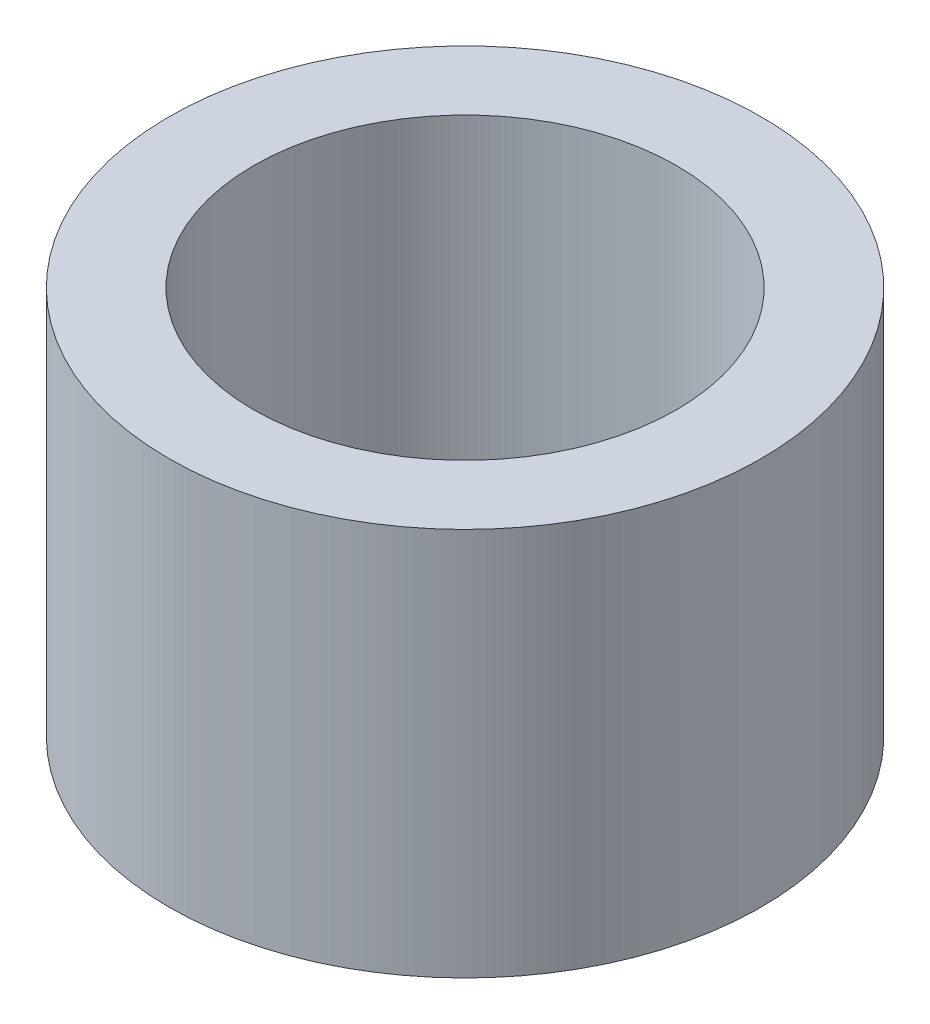
ISO-10303-21;
HEADER;
FILE_DESCRIPTION(('STEP AP214'),'2;1');
FILE_NAME('part.step','',(''),(''),'','','');
FILE_SCHEMA(('AUTOMOTIVE_DESIGN { 1 0 10303 214 1 1 1 1 }'));
ENDSEC;
DATA;
#1=APPLICATION_CONTEXT('core data for automotive mechanical design processes');
#2=APPLICATION_PROTOCOL_DEFINITION('international standard','automotive_design',2000,#1);
#3=PRODUCT_CONTEXT('',#1,'mechanical');
#4=PRODUCT('Part','Part','',(#3));
#5=PRODUCT_RELATED_PRODUCT_CATEGORY('part','',(#4));
#6=PRODUCT_DEFINITION_FORMATION('','',#4);
#7=PRODUCT_DEFINITION_CONTEXT('part definition',#1,'design');
#8=PRODUCT_DEFINITION('design','',#6,#7);
#9=PRODUCT_DEFINITION_SHAPE('','',#8);
#10=(LENGTH_UNIT() NAMED_UNIT(*) SI_UNIT(.MILLI.,.METRE.));
#11=(NAMED_UNIT(*) PLANE_ANGLE_UNIT() SI_UNIT($,.RADIAN.));
#12=(NAMED_UNIT(*) SI_UNIT($,.STERADIAN.) SOLID_ANGLE_UNIT());
#13=UNCERTAINTY_MEASURE_WITH_UNIT(LENGTH_MEASURE(1.E-05),#10,'distance_accuracy_value','');
#14=(GEOMETRIC_REPRESENTATION_CONTEXT(3) GLOBAL_UNCERTAINTY_ASSIGNED_CONTEXT((#13)) GLOBAL_UNIT_ASSIGNED_CONTEXT((#10,
#11,#12)) REPRESENTATION_CONTEXT('',''));
#15=CARTESIAN_POINT('',(0.,0.,0.));
#16=DIRECTION('',(0.,0.,1.));
#17=DIRECTION('',(1.,0.,0.));
#18=AXIS2_PLACEMENT_3D('',#15,#16,#17);
#19=CARTESIAN_POINT('',(0.,14.5796,0.));
#20=DIRECTION('',(0.,1.,0.));
#21=DIRECTION('',(0.,0.,1.));
#22=AXIS2_PLACEMENT_3D('',#19,#20,#21);
#23=PLANE('',#22);
#24=CARTESIAN_POINT('',(0.,14.5796,0.));
#25=DIRECTION('',(0.,1.,0.));
#26=DIRECTION('',(0.,0.,1.));
#27=AXIS2_PLACEMENT_3D('',#24,#25,#26);
#28=CIRCLE('',#27,11.1125);
#29=CARTESIAN_POINT('',(0.,14.5796,11.1125));
#30=VERTEX_POINT('',#29);
#31=EDGE_CURVE('E10',#30,#30,#28,.T.);
#32=ORIENTED_EDGE('',*,*,#31,.T.);
#33=EDGE_LOOP('',(#32));
#34=FACE_BOUND('',#33,.T.);
#35=CARTESIAN_POINT('',(0.,14.5796,0.));
#36=DIRECTION('',(0.,1.,0.));
#37=DIRECTION('',(0.,0.,1.));
#38=AXIS2_PLACEMENT_3D('',#35,#36,#37);
#39=CIRCLE('',#38,7.9375);
#40=CARTESIAN_POINT('',(0.,14.5796,7.9375));
#41=VERTEX_POINT('',#40);
#42=EDGE_CURVE('E42',#41,#41,#39,.T.);
#43=ORIENTED_EDGE('',*,*,#42,.F.);
#44=EDGE_LOOP('',(#43));
#45=FACE_BOUND('',#44,.T.);
#46=ADVANCED_FACE('F31',(#34,#45),#23,.T.);
#47=CARTESIAN_POINT('',(0.,0.,0.));
#48=DIRECTION('',(0.,1.,0.));
#49=DIRECTION('',(0.,0.,1.));
#50=AXIS2_PLACEMENT_3D('',#47,#48,#49);
#51=PLANE('',#50);
#52=CARTESIAN_POINT('',(0.,0.,0.));
#53=DIRECTION('',(0.,1.,0.));
#54=DIRECTION('',(0.,0.,1.));
#55=AXIS2_PLACEMENT_3D('',#52,#53,#54);
#56=CIRCLE('',#55,11.1125);
#57=CARTESIAN_POINT('',(0.,0.,11.1125));
#58=VERTEX_POINT('',#57);
#59=EDGE_CURVE('E35',#58,#58,#56,.T.);
#60=ORIENTED_EDGE('',*,*,#59,.F.);
#61=EDGE_LOOP('',(#60));
#62=FACE_BOUND('',#61,.T.);
#63=CARTESIAN_POINT('',(0.,0.,0.));
#64=DIRECTION('',(0.,1.,0.));
#65=DIRECTION('',(0.,0.,1.));
#66=AXIS2_PLACEMENT_3D('',#63,#64,#65);
#67=CIRCLE('',#66,7.9375);
#68=CARTESIAN_POINT('',(0.,0.,7.9375));
#69=VERTEX_POINT('',#68);
#70=EDGE_CURVE('E44',#69,#69,#67,.T.);
#71=ORIENTED_EDGE('',*,*,#70,.T.);
#72=EDGE_LOOP('',(#71));
#73=FACE_BOUND('',#72,.T.);
#74=ADVANCED_FACE('F54',(#62,#73),#51,.F.);
#75=CARTESIAN_POINT('',(0.,14.5796,0.));
#76=DIRECTION('',(0.,-1.,0.));
#77=DIRECTION('',(0.,0.,-1.));
#78=AXIS2_PLACEMENT_3D('',#75,#76,#77);
#79=CYLINDRICAL_SURFACE('',#78,11.1125);
#80=ORIENTED_EDGE('',*,*,#31,.F.);
#81=EDGE_LOOP('',(#80));
#82=FACE_BOUND('',#81,.T.);
#83=ORIENTED_EDGE('',*,*,#59,.T.);
#84=EDGE_LOOP('',(#83));
#85=FACE_BOUND('',#84,.T.);
#86=ADVANCED_FACE('F33',(#82,#85),#79,.T.);
#87=CARTESIAN_POINT('',(0.,14.5796,0.));
#88=DIRECTION('',(0.,-1.,0.));
#89=DIRECTION('',(0.,0.,-1.));
#90=AXIS2_PLACEMENT_3D('',#87,#88,#89);
#91=CYLINDRICAL_SURFACE('',#90,7.9375);
#92=ORIENTED_EDGE('',*,*,#42,.T.);
#93=EDGE_LOOP('',(#92));
#94=FACE_BOUND('',#93,.T.);
#95=ORIENTED_EDGE('',*,*,#70,.F.);
#96=EDGE_LOOP('',(#95));
#97=FACE_BOUND('',#96,.T.);
#98=ADVANCED_FACE('F50',(#94,#97),#91,.F.);
#99=CLOSED_SHELL('',(#46,#74,#86,#98));
#100=MANIFOLD_SOLID_BREP('B2',#99);
#101=ADVANCED_BREP_SHAPE_REPRESENTATION('',(#18,#100),#14);
#102=SHAPE_DEFINITION_REPRESENTATION(#9,#101);
ENDSEC;
END-ISO-10303-21;
